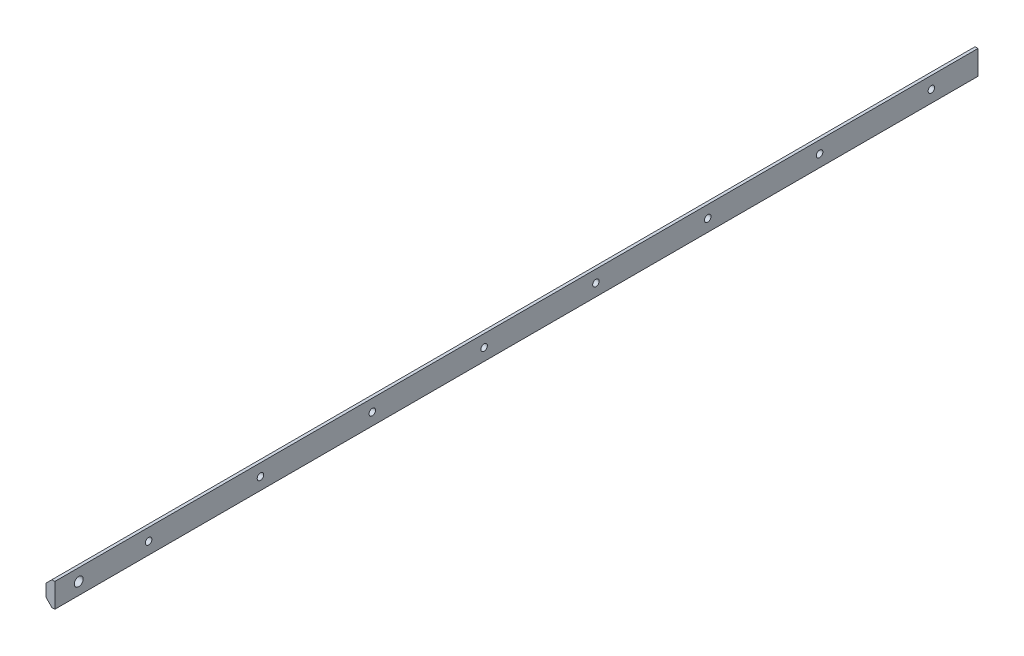
ISO-10303-21;
HEADER;
FILE_DESCRIPTION(('STEP AP214'),'2;1');
FILE_NAME('part.step','',(''),(''),'','','');
FILE_SCHEMA(('AUTOMOTIVE_DESIGN { 1 0 10303 214 1 1 1 1 }'));
ENDSEC;
DATA;
#1=APPLICATION_CONTEXT('core data for automotive mechanical design processes');
#2=APPLICATION_PROTOCOL_DEFINITION('international standard','automotive_design',2000,#1);
#3=PRODUCT_CONTEXT('',#1,'mechanical');
#4=PRODUCT('Part','Part','',(#3));
#5=PRODUCT_RELATED_PRODUCT_CATEGORY('part','',(#4));
#6=PRODUCT_DEFINITION_FORMATION('','',#4);
#7=PRODUCT_DEFINITION_CONTEXT('part definition',#1,'design');
#8=PRODUCT_DEFINITION('design','',#6,#7);
#9=PRODUCT_DEFINITION_SHAPE('','',#8);
#10=(LENGTH_UNIT() NAMED_UNIT(*) SI_UNIT(.MILLI.,.METRE.));
#11=(NAMED_UNIT(*) PLANE_ANGLE_UNIT() SI_UNIT($,.RADIAN.));
#12=(NAMED_UNIT(*) SI_UNIT($,.STERADIAN.) SOLID_ANGLE_UNIT());
#13=UNCERTAINTY_MEASURE_WITH_UNIT(LENGTH_MEASURE(1.E-05),#10,'distance_accuracy_value','');
#14=(GEOMETRIC_REPRESENTATION_CONTEXT(3) GLOBAL_UNCERTAINTY_ASSIGNED_CONTEXT((#13)) GLOBAL_UNIT_ASSIGNED_CONTEXT((#10,
#11,#12)) REPRESENTATION_CONTEXT('',''));
#15=CARTESIAN_POINT('',(0.,0.,0.));
#16=DIRECTION('',(0.,0.,1.));
#17=DIRECTION('',(1.,0.,0.));
#18=AXIS2_PLACEMENT_3D('',#15,#16,#17);
#19=CARTESIAN_POINT('',(223.588585177783,192.984077133914,-495.29818044515));
#20=DIRECTION('',(-1.,0.,0.));
#21=DIRECTION('',(0.,0.,1.));
#22=AXIS2_PLACEMENT_3D('',#19,#20,#21);
#23=PLANE('',#22);
#24=CARTESIAN_POINT('',(223.588585177783,186.509282678352,-410.298180445181));
#25=DIRECTION('',(1.,0.,0.));
#26=DIRECTION('',(0.,0.,-1.));
#27=AXIS2_PLACEMENT_3D('',#24,#25,#26);
#28=CIRCLE('',#27,1.75);
#29=CARTESIAN_POINT('',(223.588585177783,186.509282678352,-412.048180445181));
#30=VERTEX_POINT('',#29);
#31=EDGE_CURVE('E232',#30,#30,#28,.T.);
#32=ORIENTED_EDGE('',*,*,#31,.F.);
#33=EDGE_LOOP('',(#32));
#34=FACE_BOUND('',#33,.T.);
#35=CARTESIAN_POINT('',(223.588585177783,186.509282678352,-350.298180445181));
#36=DIRECTION('',(1.,0.,0.));
#37=DIRECTION('',(0.,0.,-1.));
#38=AXIS2_PLACEMENT_3D('',#35,#36,#37);
#39=CIRCLE('',#38,1.75);
#40=CARTESIAN_POINT('',(223.588585177783,186.509282678352,-352.048180445182));
#41=VERTEX_POINT('',#40);
#42=EDGE_CURVE('E240',#41,#41,#39,.T.);
#43=ORIENTED_EDGE('',*,*,#42,.F.);
#44=EDGE_LOOP('',(#43));
#45=FACE_BOUND('',#44,.T.);
#46=CARTESIAN_POINT('',(223.588585177783,186.509282678352,-290.298180445181));
#47=DIRECTION('',(1.,0.,0.));
#48=DIRECTION('',(0.,0.,-1.));
#49=AXIS2_PLACEMENT_3D('',#46,#47,#48);
#50=CIRCLE('',#49,1.75);
#51=CARTESIAN_POINT('',(223.588585177783,186.509282678352,-292.048180445181));
#52=VERTEX_POINT('',#51);
#53=EDGE_CURVE('E246',#52,#52,#50,.T.);
#54=ORIENTED_EDGE('',*,*,#53,.F.);
#55=EDGE_LOOP('',(#54));
#56=FACE_BOUND('',#55,.T.);
#57=CARTESIAN_POINT('',(223.588585177783,186.509282678352,-170.298180445181));
#58=DIRECTION('',(1.,0.,0.));
#59=DIRECTION('',(0.,0.,-1.));
#60=AXIS2_PLACEMENT_3D('',#57,#58,#59);
#61=CIRCLE('',#60,1.75);
#62=CARTESIAN_POINT('',(223.588585177783,186.509282678352,-172.048180445181));
#63=VERTEX_POINT('',#62);
#64=EDGE_CURVE('E252',#63,#63,#61,.T.);
#65=ORIENTED_EDGE('',*,*,#64,.F.);
#66=EDGE_LOOP('',(#65));
#67=FACE_BOUND('',#66,.T.);
#68=CARTESIAN_POINT('',(223.588585177783,186.509282678352,-110.298180445181));
#69=DIRECTION('',(1.,0.,0.));
#70=DIRECTION('',(0.,0.,-1.));
#71=AXIS2_PLACEMENT_3D('',#68,#69,#70);
#72=CIRCLE('',#71,1.75);
#73=CARTESIAN_POINT('',(223.588585177783,186.509282678352,-112.048180445181));
#74=VERTEX_POINT('',#73);
#75=EDGE_CURVE('E258',#74,#74,#72,.T.);
#76=ORIENTED_EDGE('',*,*,#75,.F.);
#77=EDGE_LOOP('',(#76));
#78=FACE_BOUND('',#77,.T.);
#79=CARTESIAN_POINT('',(223.588585177783,186.509282678352,-230.298180445181));
#80=DIRECTION('',(1.,0.,0.));
#81=DIRECTION('',(0.,0.,-1.));
#82=AXIS2_PLACEMENT_3D('',#79,#80,#81);
#83=CIRCLE('',#82,1.75);
#84=CARTESIAN_POINT('',(223.588585177783,186.509282678352,-232.048180445181));
#85=VERTEX_POINT('',#84);
#86=EDGE_CURVE('E270',#85,#85,#83,.T.);
#87=ORIENTED_EDGE('',*,*,#86,.F.);
#88=EDGE_LOOP('',(#87));
#89=FACE_BOUND('',#88,.T.);
#90=CARTESIAN_POINT('',(223.588585177783,186.50928267853,-12.7981804711471));
#91=DIRECTION('',(1.,0.,0.));
#92=DIRECTION('',(0.,0.,-1.));
#93=AXIS2_PLACEMENT_3D('',#90,#91,#92);
#94=CIRCLE('',#93,2.38125);
#95=CARTESIAN_POINT('',(223.588585177783,186.50928267853,-15.1794304711471));
#96=VERTEX_POINT('',#95);
#97=EDGE_CURVE('E276',#96,#96,#94,.T.);
#98=ORIENTED_EDGE('',*,*,#97,.F.);
#99=EDGE_LOOP('',(#98));
#100=FACE_BOUND('',#99,.T.);
#101=DIRECTION('',(0.,-1.,0.));
#102=VECTOR('',#101,1.);
#103=CARTESIAN_POINT('',(223.588585177783,192.984077133914,0.));
#104=LINE('',#103,#102);
#105=CARTESIAN_POINT('',(223.588585177783,192.984077133914,0.));
#106=VERTEX_POINT('',#105);
#107=CARTESIAN_POINT('',(223.588585177783,180.034488222789,0.));
#108=VERTEX_POINT('',#107);
#109=EDGE_CURVE('E128',#106,#108,#104,.T.);
#110=ORIENTED_EDGE('',*,*,#109,.T.);
#111=DIRECTION('',(0.,0.,1.));
#112=VECTOR('',#111,1.);
#113=CARTESIAN_POINT('',(223.588585177783,180.034488222789,-495.29818044515));
#114=LINE('',#113,#112);
#115=CARTESIAN_POINT('',(223.588585177783,180.034488222789,-495.29818044515));
#116=VERTEX_POINT('',#115);
#117=EDGE_CURVE('E115',#116,#108,#114,.T.);
#118=ORIENTED_EDGE('',*,*,#117,.F.);
#119=DIRECTION('',(0.,-1.,0.));
#120=VECTOR('',#119,1.);
#121=CARTESIAN_POINT('',(223.588585177783,192.984077133914,-495.29818044515));
#122=LINE('',#121,#120);
#123=CARTESIAN_POINT('',(223.588585177783,192.984077133914,-495.29818044515));
#124=VERTEX_POINT('',#123);
#125=EDGE_CURVE('E99',#124,#116,#122,.T.);
#126=ORIENTED_EDGE('',*,*,#125,.F.);
#127=DIRECTION('',(0.,0.,1.));
#128=VECTOR('',#127,1.);
#129=CARTESIAN_POINT('',(223.588585177783,192.984077133914,-495.29818044515));
#130=LINE('',#129,#128);
#131=EDGE_CURVE('E108',#124,#106,#130,.T.);
#132=ORIENTED_EDGE('',*,*,#131,.T.);
#133=EDGE_LOOP('',(#110,#118,#126,#132));
#134=FACE_BOUND('',#133,.T.);
#135=CARTESIAN_POINT('',(223.588585177783,186.509282678352,-50.2981804451814));
#136=DIRECTION('',(1.,0.,0.));
#137=DIRECTION('',(0.,0.,-1.));
#138=AXIS2_PLACEMENT_3D('',#135,#136,#137);
#139=CIRCLE('',#138,1.75);
#140=CARTESIAN_POINT('',(223.588585177783,186.509282678352,-52.0481804451814));
#141=VERTEX_POINT('',#140);
#142=EDGE_CURVE('E264',#141,#141,#139,.T.);
#143=ORIENTED_EDGE('',*,*,#142,.F.);
#144=EDGE_LOOP('',(#143));
#145=FACE_BOUND('',#144,.T.);
#146=CARTESIAN_POINT('',(223.588585177783,186.509282678352,-470.298180445181));
#147=DIRECTION('',(1.,0.,0.));
#148=DIRECTION('',(0.,0.,-1.));
#149=AXIS2_PLACEMENT_3D('',#146,#147,#148);
#150=CIRCLE('',#149,1.75);
#151=CARTESIAN_POINT('',(223.588585177783,186.509282678352,-472.048180445182));
#152=VERTEX_POINT('',#151);
#153=EDGE_CURVE('E229',#152,#152,#150,.T.);
#154=ORIENTED_EDGE('',*,*,#153,.F.);
#155=EDGE_LOOP('',(#154));
#156=FACE_BOUND('',#155,.T.);
#157=ADVANCED_FACE('F40',(#34,#45,#56,#67,#78,#89,#100,#134,#145,#156),#23,.F.);
#158=CARTESIAN_POINT('',(218.826085177783,192.984077133914,-495.29818044515));
#159=DIRECTION('',(1.,0.,0.));
#160=DIRECTION('',(0.,0.,-1.));
#161=AXIS2_PLACEMENT_3D('',#158,#159,#160);
#162=PLANE('',#161);
#163=CARTESIAN_POINT('',(218.826085177783,186.509282678352,-470.298180445181));
#164=DIRECTION('',(1.,0.,0.));
#165=DIRECTION('',(0.,0.,-1.));
#166=AXIS2_PLACEMENT_3D('',#163,#164,#165);
#167=CIRCLE('',#166,1.75);
#168=CARTESIAN_POINT('',(218.826085177783,186.509282678352,-472.048180445182));
#169=VERTEX_POINT('',#168);
#170=EDGE_CURVE('E226',#169,#169,#167,.T.);
#171=ORIENTED_EDGE('',*,*,#170,.T.);
#172=EDGE_LOOP('',(#171));
#173=FACE_BOUND('',#172,.T.);
#174=CARTESIAN_POINT('',(218.826085177783,186.509282678352,-410.298180445181));
#175=DIRECTION('',(1.,0.,0.));
#176=DIRECTION('',(0.,0.,-1.));
#177=AXIS2_PLACEMENT_3D('',#174,#175,#176);
#178=CIRCLE('',#177,1.75);
#179=CARTESIAN_POINT('',(218.826085177783,186.509282678352,-412.048180445181));
#180=VERTEX_POINT('',#179);
#181=EDGE_CURVE('E237',#180,#180,#178,.T.);
#182=ORIENTED_EDGE('',*,*,#181,.T.);
#183=EDGE_LOOP('',(#182));
#184=FACE_BOUND('',#183,.T.);
#185=CARTESIAN_POINT('',(218.826085177783,186.509282678352,-350.298180445181));
#186=DIRECTION('',(1.,0.,0.));
#187=DIRECTION('',(0.,0.,-1.));
#188=AXIS2_PLACEMENT_3D('',#185,#186,#187);
#189=CIRCLE('',#188,1.75);
#190=CARTESIAN_POINT('',(218.826085177783,186.509282678352,-352.048180445182));
#191=VERTEX_POINT('',#190);
#192=EDGE_CURVE('E243',#191,#191,#189,.T.);
#193=ORIENTED_EDGE('',*,*,#192,.T.);
#194=EDGE_LOOP('',(#193));
#195=FACE_BOUND('',#194,.T.);
#196=CARTESIAN_POINT('',(218.826085177783,186.509282678352,-290.298180445181));
#197=DIRECTION('',(1.,0.,0.));
#198=DIRECTION('',(0.,0.,-1.));
#199=AXIS2_PLACEMENT_3D('',#196,#197,#198);
#200=CIRCLE('',#199,1.75);
#201=CARTESIAN_POINT('',(218.826085177783,186.509282678352,-292.048180445181));
#202=VERTEX_POINT('',#201);
#203=EDGE_CURVE('E249',#202,#202,#200,.T.);
#204=ORIENTED_EDGE('',*,*,#203,.T.);
#205=EDGE_LOOP('',(#204));
#206=FACE_BOUND('',#205,.T.);
#207=CARTESIAN_POINT('',(218.826085177783,186.509282678352,-170.298180445181));
#208=DIRECTION('',(1.,0.,0.));
#209=DIRECTION('',(0.,0.,-1.));
#210=AXIS2_PLACEMENT_3D('',#207,#208,#209);
#211=CIRCLE('',#210,1.75);
#212=CARTESIAN_POINT('',(218.826085177783,186.509282678352,-172.048180445181));
#213=VERTEX_POINT('',#212);
#214=EDGE_CURVE('E255',#213,#213,#211,.T.);
#215=ORIENTED_EDGE('',*,*,#214,.T.);
#216=EDGE_LOOP('',(#215));
#217=FACE_BOUND('',#216,.T.);
#218=CARTESIAN_POINT('',(218.826085177783,186.509282678352,-110.298180445181));
#219=DIRECTION('',(1.,0.,0.));
#220=DIRECTION('',(0.,0.,-1.));
#221=AXIS2_PLACEMENT_3D('',#218,#219,#220);
#222=CIRCLE('',#221,1.75);
#223=CARTESIAN_POINT('',(218.826085177783,186.509282678352,-112.048180445181));
#224=VERTEX_POINT('',#223);
#225=EDGE_CURVE('E261',#224,#224,#222,.T.);
#226=ORIENTED_EDGE('',*,*,#225,.T.);
#227=EDGE_LOOP('',(#226));
#228=FACE_BOUND('',#227,.T.);
#229=CARTESIAN_POINT('',(218.826085177783,186.509282678352,-50.2981804451814));
#230=DIRECTION('',(1.,0.,0.));
#231=DIRECTION('',(0.,0.,-1.));
#232=AXIS2_PLACEMENT_3D('',#229,#230,#231);
#233=CIRCLE('',#232,1.75);
#234=CARTESIAN_POINT('',(218.826085177783,186.509282678352,-52.0481804451814));
#235=VERTEX_POINT('',#234);
#236=EDGE_CURVE('E267',#235,#235,#233,.T.);
#237=ORIENTED_EDGE('',*,*,#236,.T.);
#238=EDGE_LOOP('',(#237));
#239=FACE_BOUND('',#238,.T.);
#240=CARTESIAN_POINT('',(218.826085177783,186.509282678352,-230.298180445181));
#241=DIRECTION('',(1.,0.,0.));
#242=DIRECTION('',(0.,0.,-1.));
#243=AXIS2_PLACEMENT_3D('',#240,#241,#242);
#244=CIRCLE('',#243,1.75);
#245=CARTESIAN_POINT('',(218.826085177783,186.509282678352,-232.048180445181));
#246=VERTEX_POINT('',#245);
#247=EDGE_CURVE('E273',#246,#246,#244,.T.);
#248=ORIENTED_EDGE('',*,*,#247,.T.);
#249=EDGE_LOOP('',(#248));
#250=FACE_BOUND('',#249,.T.);
#251=CARTESIAN_POINT('',(218.826085177783,186.50928267853,-12.7981804711471));
#252=DIRECTION('',(1.,0.,0.));
#253=DIRECTION('',(0.,0.,-1.));
#254=AXIS2_PLACEMENT_3D('',#251,#252,#253);
#255=CIRCLE('',#254,2.38125);
#256=CARTESIAN_POINT('',(218.826085177783,186.50928267853,-15.1794304711471));
#257=VERTEX_POINT('',#256);
#258=EDGE_CURVE('E126',#257,#257,#255,.T.);
#259=ORIENTED_EDGE('',*,*,#258,.T.);
#260=EDGE_LOOP('',(#259));
#261=FACE_BOUND('',#260,.T.);
#262=DIRECTION('',(0.,1.,0.));
#263=VECTOR('',#262,1.);
#264=CARTESIAN_POINT('',(218.826085177783,192.984077133914,0.));
#265=LINE('',#264,#263);
#266=CARTESIAN_POINT('',(218.826085177783,183.209488222789,0.));
#267=VERTEX_POINT('',#266);
#268=CARTESIAN_POINT('',(218.826085177783,189.809077133914,0.));
#269=VERTEX_POINT('',#268);
#270=EDGE_CURVE('E124',#267,#269,#265,.T.);
#271=ORIENTED_EDGE('',*,*,#270,.T.);
#272=DIRECTION('',(0.,0.,-1.));
#273=VECTOR('',#272,1.);
#274=CARTESIAN_POINT('',(218.826085177783,189.809077133914,-495.29818044515));
#275=LINE('',#274,#273);
#276=CARTESIAN_POINT('',(218.826085177783,189.809077133914,-495.29818044515));
#277=VERTEX_POINT('',#276);
#278=EDGE_CURVE('E62',#269,#277,#275,.T.);
#279=ORIENTED_EDGE('',*,*,#278,.T.);
#280=DIRECTION('',(0.,1.,0.));
#281=VECTOR('',#280,1.);
#282=CARTESIAN_POINT('',(218.826085177783,192.984077133914,-495.29818044515));
#283=LINE('',#282,#281);
#284=CARTESIAN_POINT('',(218.826085177783,183.209488222789,-495.29818044515));
#285=VERTEX_POINT('',#284);
#286=EDGE_CURVE('E105',#285,#277,#283,.T.);
#287=ORIENTED_EDGE('',*,*,#286,.F.);
#288=DIRECTION('',(0.,0.,1.));
#289=VECTOR('',#288,1.);
#290=CARTESIAN_POINT('',(218.826085177783,183.209488222789,-495.29818044515));
#291=LINE('',#290,#289);
#292=EDGE_CURVE('E138',#285,#267,#291,.T.);
#293=ORIENTED_EDGE('',*,*,#292,.T.);
#294=EDGE_LOOP('',(#271,#279,#287,#293));
#295=FACE_BOUND('',#294,.T.);
#296=ADVANCED_FACE('F146',(#173,#184,#195,#206,#217,#228,#239,#250,#261,#295),#162,.F.);
#297=CARTESIAN_POINT('',(223.588585177783,192.984077133914,-495.29818044515));
#298=DIRECTION('',(0.,-1.,0.));
#299=DIRECTION('',(0.,0.,-1.));
#300=AXIS2_PLACEMENT_3D('',#297,#298,#299);
#301=PLANE('',#300);
#302=DIRECTION('',(1.,0.,0.));
#303=VECTOR('',#302,1.);
#304=CARTESIAN_POINT('',(223.588585177783,192.984077133914,-495.29818044515));
#305=LINE('',#304,#303);
#306=CARTESIAN_POINT('',(222.001085177783,192.984077133914,-495.29818044515));
#307=VERTEX_POINT('',#306);
#308=EDGE_CURVE('E95',#307,#124,#305,.T.);
#309=ORIENTED_EDGE('',*,*,#308,.F.);
#310=DIRECTION('',(0.,0.,1.));
#311=VECTOR('',#310,1.);
#312=CARTESIAN_POINT('',(222.001085177783,192.984077133914,-495.29818044515));
#313=LINE('',#312,#311);
#314=CARTESIAN_POINT('',(222.001085177783,192.984077133914,0.));
#315=VERTEX_POINT('',#314);
#316=EDGE_CURVE('E114',#307,#315,#313,.T.);
#317=ORIENTED_EDGE('',*,*,#316,.T.);
#318=DIRECTION('',(1.,0.,0.));
#319=VECTOR('',#318,1.);
#320=CARTESIAN_POINT('',(223.588585177783,192.984077133914,0.));
#321=LINE('',#320,#319);
#322=EDGE_CURVE('E111',#315,#106,#321,.T.);
#323=ORIENTED_EDGE('',*,*,#322,.T.);
#324=ORIENTED_EDGE('',*,*,#131,.F.);
#325=EDGE_LOOP('',(#309,#317,#323,#324));
#326=FACE_BOUND('',#325,.T.);
#327=ADVANCED_FACE('F109',(#326),#301,.F.);
#328=CARTESIAN_POINT('',(223.588585177783,180.034488222789,-495.29818044515));
#329=DIRECTION('',(0.,1.,0.));
#330=DIRECTION('',(-1.,0.,0.));
#331=AXIS2_PLACEMENT_3D('',#328,#329,#330);
#332=PLANE('',#331);
#333=DIRECTION('',(-1.,0.,0.));
#334=VECTOR('',#333,1.);
#335=CARTESIAN_POINT('',(223.588585177783,180.034488222789,0.));
#336=LINE('',#335,#334);
#337=CARTESIAN_POINT('',(222.001085177783,180.034488222789,0.));
#338=VERTEX_POINT('',#337);
#339=EDGE_CURVE('E130',#108,#338,#336,.T.);
#340=ORIENTED_EDGE('',*,*,#339,.T.);
#341=DIRECTION('',(0.,0.,-1.));
#342=VECTOR('',#341,1.);
#343=CARTESIAN_POINT('',(222.001085177783,180.034488222789,-495.29818044515));
#344=LINE('',#343,#342);
#345=CARTESIAN_POINT('',(222.001085177783,180.034488222789,-495.29818044515));
#346=VERTEX_POINT('',#345);
#347=EDGE_CURVE('E11',#338,#346,#344,.T.);
#348=ORIENTED_EDGE('',*,*,#347,.T.);
#349=DIRECTION('',(-1.,0.,0.));
#350=VECTOR('',#349,1.);
#351=CARTESIAN_POINT('',(223.588585177783,180.034488222789,-495.29818044515));
#352=LINE('',#351,#350);
#353=EDGE_CURVE('E119',#116,#346,#352,.T.);
#354=ORIENTED_EDGE('',*,*,#353,.F.);
#355=ORIENTED_EDGE('',*,*,#117,.T.);
#356=EDGE_LOOP('',(#340,#348,#354,#355));
#357=FACE_BOUND('',#356,.T.);
#358=ADVANCED_FACE('F151',(#357),#332,.F.);
#359=CARTESIAN_POINT('',(0.,0.,-495.29818044515));
#360=DIRECTION('',(0.,0.,-1.));
#361=DIRECTION('',(-1.,0.,0.));
#362=AXIS2_PLACEMENT_3D('',#359,#360,#361);
#363=PLANE('',#362);
#364=ORIENTED_EDGE('',*,*,#286,.T.);
#365=DIRECTION('',(-0.707106781186548,-0.707106781186548,0.));
#366=VECTOR('',#365,1.);
#367=CARTESIAN_POINT('',(14.5085040219345,-14.5085040219345,-495.29818044515));
#368=LINE('',#367,#366);
#369=EDGE_CURVE('E49',#277,#307,#368,.F.);
#370=ORIENTED_EDGE('',*,*,#369,.T.);
#371=ORIENTED_EDGE('',*,*,#308,.T.);
#372=ORIENTED_EDGE('',*,*,#125,.T.);
#373=ORIENTED_EDGE('',*,*,#353,.T.);
#374=DIRECTION('',(0.707106781186548,-0.707106781186548,0.));
#375=VECTOR('',#374,1.);
#376=CARTESIAN_POINT('',(201.017786700286,201.017786700286,-495.29818044515));
#377=LINE('',#376,#375);
#378=EDGE_CURVE('E142',#346,#285,#377,.F.);
#379=ORIENTED_EDGE('',*,*,#378,.T.);
#380=EDGE_LOOP('',(#364,#370,#371,#372,#373,#379));
#381=FACE_BOUND('',#380,.T.);
#382=ADVANCED_FACE('F97',(#381),#363,.T.);
#383=CARTESIAN_POINT('',(0.,0.,0.));
#384=DIRECTION('',(0.,0.,-1.));
#385=DIRECTION('',(-1.,0.,0.));
#386=AXIS2_PLACEMENT_3D('',#383,#384,#385);
#387=PLANE('',#386);
#388=ORIENTED_EDGE('',*,*,#322,.F.);
#389=DIRECTION('',(0.707106781186548,0.707106781186548,0.));
#390=VECTOR('',#389,1.);
#391=CARTESIAN_POINT('',(222.001085177783,192.984077133914,0.));
#392=LINE('',#391,#390);
#393=EDGE_CURVE('E136',#315,#269,#392,.F.);
#394=ORIENTED_EDGE('',*,*,#393,.T.);
#395=ORIENTED_EDGE('',*,*,#270,.F.);
#396=DIRECTION('',(-0.707106781186548,0.707106781186548,0.));
#397=VECTOR('',#396,1.);
#398=CARTESIAN_POINT('',(218.826085177783,183.209488222789,0.));
#399=LINE('',#398,#397);
#400=EDGE_CURVE('E134',#267,#338,#399,.F.);
#401=ORIENTED_EDGE('',*,*,#400,.T.);
#402=ORIENTED_EDGE('',*,*,#339,.F.);
#403=ORIENTED_EDGE('',*,*,#109,.F.);
#404=EDGE_LOOP('',(#388,#394,#395,#401,#402,#403));
#405=FACE_BOUND('',#404,.T.);
#406=ADVANCED_FACE('F150',(#405),#387,.F.);
#407=CARTESIAN_POINT('',(223.588585177783,186.50928267853,-12.7981804711471));
#408=DIRECTION('',(1.,0.,0.));
#409=DIRECTION('',(0.,0.,-1.));
#410=AXIS2_PLACEMENT_3D('',#407,#408,#409);
#411=CYLINDRICAL_SURFACE('',#410,2.38125);
#412=ORIENTED_EDGE('',*,*,#258,.F.);
#413=EDGE_LOOP('',(#412));
#414=FACE_BOUND('',#413,.T.);
#415=ORIENTED_EDGE('',*,*,#97,.T.);
#416=EDGE_LOOP('',(#415));
#417=FACE_BOUND('',#416,.T.);
#418=ADVANCED_FACE('F176',(#414,#417),#411,.F.);
#419=CARTESIAN_POINT('',(222.001085177783,192.984077133914,-495.29818044515));
#420=DIRECTION('',(0.707106781186548,-0.707106781186548,0.));
#421=DIRECTION('',(0.,0.,1.));
#422=AXIS2_PLACEMENT_3D('',#419,#420,#421);
#423=PLANE('',#422);
#424=ORIENTED_EDGE('',*,*,#369,.F.);
#425=ORIENTED_EDGE('',*,*,#278,.F.);
#426=ORIENTED_EDGE('',*,*,#393,.F.);
#427=ORIENTED_EDGE('',*,*,#316,.F.);
#428=EDGE_LOOP('',(#424,#425,#426,#427));
#429=FACE_BOUND('',#428,.T.);
#430=ADVANCED_FACE('F172',(#429),#423,.F.);
#431=CARTESIAN_POINT('',(218.826085177783,183.209488222789,-495.29818044515));
#432=DIRECTION('',(0.707106781186548,0.707106781186548,0.));
#433=DIRECTION('',(0.,0.,1.));
#434=AXIS2_PLACEMENT_3D('',#431,#432,#433);
#435=PLANE('',#434);
#436=ORIENTED_EDGE('',*,*,#378,.F.);
#437=ORIENTED_EDGE('',*,*,#347,.F.);
#438=ORIENTED_EDGE('',*,*,#400,.F.);
#439=ORIENTED_EDGE('',*,*,#292,.F.);
#440=EDGE_LOOP('',(#436,#437,#438,#439));
#441=FACE_BOUND('',#440,.T.);
#442=ADVANCED_FACE('F43',(#441),#435,.F.);
#443=CARTESIAN_POINT('',(223.588585177783,186.509282678352,-230.298180445181));
#444=DIRECTION('',(1.,0.,0.));
#445=DIRECTION('',(0.,0.,-1.));
#446=AXIS2_PLACEMENT_3D('',#443,#444,#445);
#447=CYLINDRICAL_SURFACE('',#446,1.75);
#448=ORIENTED_EDGE('',*,*,#247,.F.);
#449=EDGE_LOOP('',(#448));
#450=FACE_BOUND('',#449,.T.);
#451=ORIENTED_EDGE('',*,*,#86,.T.);
#452=EDGE_LOOP('',(#451));
#453=FACE_BOUND('',#452,.T.);
#454=ADVANCED_FACE('F182',(#450,#453),#447,.F.);
#455=CARTESIAN_POINT('',(223.588585177783,186.509282678352,-50.2981804451814));
#456=DIRECTION('',(1.,0.,0.));
#457=DIRECTION('',(0.,0.,-1.));
#458=AXIS2_PLACEMENT_3D('',#455,#456,#457);
#459=CYLINDRICAL_SURFACE('',#458,1.75);
#460=ORIENTED_EDGE('',*,*,#236,.F.);
#461=EDGE_LOOP('',(#460));
#462=FACE_BOUND('',#461,.T.);
#463=ORIENTED_EDGE('',*,*,#142,.T.);
#464=EDGE_LOOP('',(#463));
#465=FACE_BOUND('',#464,.T.);
#466=ADVANCED_FACE('F193',(#462,#465),#459,.F.);
#467=CARTESIAN_POINT('',(223.588585177783,186.509282678352,-110.298180445181));
#468=DIRECTION('',(1.,0.,0.));
#469=DIRECTION('',(0.,0.,-1.));
#470=AXIS2_PLACEMENT_3D('',#467,#468,#469);
#471=CYLINDRICAL_SURFACE('',#470,1.75);
#472=ORIENTED_EDGE('',*,*,#225,.F.);
#473=EDGE_LOOP('',(#472));
#474=FACE_BOUND('',#473,.T.);
#475=ORIENTED_EDGE('',*,*,#75,.T.);
#476=EDGE_LOOP('',(#475));
#477=FACE_BOUND('',#476,.T.);
#478=ADVANCED_FACE('F197',(#474,#477),#471,.F.);
#479=CARTESIAN_POINT('',(223.588585177783,186.509282678352,-170.298180445181));
#480=DIRECTION('',(1.,0.,0.));
#481=DIRECTION('',(0.,0.,-1.));
#482=AXIS2_PLACEMENT_3D('',#479,#480,#481);
#483=CYLINDRICAL_SURFACE('',#482,1.75);
#484=ORIENTED_EDGE('',*,*,#214,.F.);
#485=EDGE_LOOP('',(#484));
#486=FACE_BOUND('',#485,.T.);
#487=ORIENTED_EDGE('',*,*,#64,.T.);
#488=EDGE_LOOP('',(#487));
#489=FACE_BOUND('',#488,.T.);
#490=ADVANCED_FACE('F201',(#486,#489),#483,.F.);
#491=CARTESIAN_POINT('',(223.588585177783,186.509282678352,-290.298180445181));
#492=DIRECTION('',(1.,0.,0.));
#493=DIRECTION('',(0.,0.,-1.));
#494=AXIS2_PLACEMENT_3D('',#491,#492,#493);
#495=CYLINDRICAL_SURFACE('',#494,1.75);
#496=ORIENTED_EDGE('',*,*,#203,.F.);
#497=EDGE_LOOP('',(#496));
#498=FACE_BOUND('',#497,.T.);
#499=ORIENTED_EDGE('',*,*,#53,.T.);
#500=EDGE_LOOP('',(#499));
#501=FACE_BOUND('',#500,.T.);
#502=ADVANCED_FACE('F205',(#498,#501),#495,.F.);
#503=CARTESIAN_POINT('',(223.588585177783,186.509282678352,-350.298180445181));
#504=DIRECTION('',(1.,0.,0.));
#505=DIRECTION('',(0.,0.,-1.));
#506=AXIS2_PLACEMENT_3D('',#503,#504,#505);
#507=CYLINDRICAL_SURFACE('',#506,1.75);
#508=ORIENTED_EDGE('',*,*,#192,.F.);
#509=EDGE_LOOP('',(#508));
#510=FACE_BOUND('',#509,.T.);
#511=ORIENTED_EDGE('',*,*,#42,.T.);
#512=EDGE_LOOP('',(#511));
#513=FACE_BOUND('',#512,.T.);
#514=ADVANCED_FACE('F209',(#510,#513),#507,.F.);
#515=CARTESIAN_POINT('',(223.588585177783,186.509282678352,-410.298180445181));
#516=DIRECTION('',(1.,0.,0.));
#517=DIRECTION('',(0.,0.,-1.));
#518=AXIS2_PLACEMENT_3D('',#515,#516,#517);
#519=CYLINDRICAL_SURFACE('',#518,1.75);
#520=ORIENTED_EDGE('',*,*,#181,.F.);
#521=EDGE_LOOP('',(#520));
#522=FACE_BOUND('',#521,.T.);
#523=ORIENTED_EDGE('',*,*,#31,.T.);
#524=EDGE_LOOP('',(#523));
#525=FACE_BOUND('',#524,.T.);
#526=ADVANCED_FACE('F213',(#522,#525),#519,.F.);
#527=CARTESIAN_POINT('',(223.588585177783,186.509282678352,-470.298180445181));
#528=DIRECTION('',(1.,0.,0.));
#529=DIRECTION('',(0.,0.,-1.));
#530=AXIS2_PLACEMENT_3D('',#527,#528,#529);
#531=CYLINDRICAL_SURFACE('',#530,1.75);
#532=ORIENTED_EDGE('',*,*,#170,.F.);
#533=EDGE_LOOP('',(#532));
#534=FACE_BOUND('',#533,.T.);
#535=ORIENTED_EDGE('',*,*,#153,.T.);
#536=EDGE_LOOP('',(#535));
#537=FACE_BOUND('',#536,.T.);
#538=ADVANCED_FACE('F217',(#534,#537),#531,.F.);
#539=CLOSED_SHELL('',(#157,#296,#327,#358,#382,#406,#418,#430,#442,#454,#466,#478,#490,#502,
#514,#526,#538));
#540=MANIFOLD_SOLID_BREP('B2',#539);
#541=ADVANCED_BREP_SHAPE_REPRESENTATION('',(#18,#540),#14);
#542=SHAPE_DEFINITION_REPRESENTATION(#9,#541);
ENDSEC;
END-ISO-10303-21;
